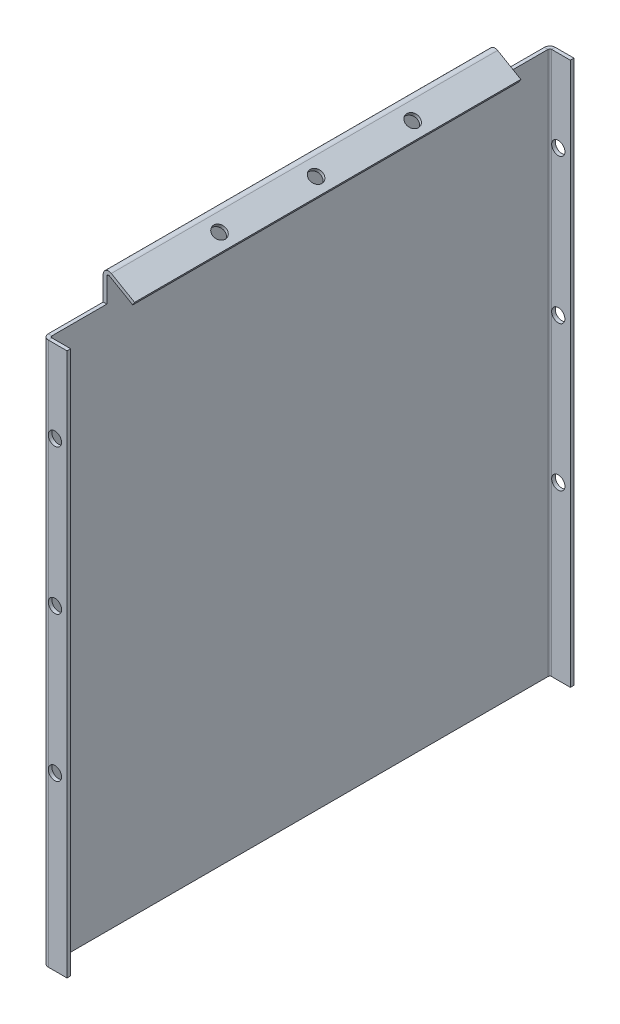
ISO-10303-21;
HEADER;
FILE_DESCRIPTION(('STEP AP214'),'2;1');
FILE_NAME('part.step','',(''),(''),'','','');
FILE_SCHEMA(('AUTOMOTIVE_DESIGN { 1 0 10303 214 1 1 1 1 }'));
ENDSEC;
DATA;
#1=APPLICATION_CONTEXT('core data for automotive mechanical design processes');
#2=APPLICATION_PROTOCOL_DEFINITION('international standard','automotive_design',2000,#1);
#3=PRODUCT_CONTEXT('',#1,'mechanical');
#4=PRODUCT('Part','Part','',(#3));
#5=PRODUCT_RELATED_PRODUCT_CATEGORY('part','',(#4));
#6=PRODUCT_DEFINITION_FORMATION('','',#4);
#7=PRODUCT_DEFINITION_CONTEXT('part definition',#1,'design');
#8=PRODUCT_DEFINITION('design','',#6,#7);
#9=PRODUCT_DEFINITION_SHAPE('','',#8);
#10=(LENGTH_UNIT() NAMED_UNIT(*) SI_UNIT(.MILLI.,.METRE.));
#11=(NAMED_UNIT(*) PLANE_ANGLE_UNIT() SI_UNIT($,.RADIAN.));
#12=(NAMED_UNIT(*) SI_UNIT($,.STERADIAN.) SOLID_ANGLE_UNIT());
#13=UNCERTAINTY_MEASURE_WITH_UNIT(LENGTH_MEASURE(1.E-05),#10,'distance_accuracy_value','');
#14=(GEOMETRIC_REPRESENTATION_CONTEXT(3) GLOBAL_UNCERTAINTY_ASSIGNED_CONTEXT((#13)) GLOBAL_UNIT_ASSIGNED_CONTEXT((#10,
#11,#12)) REPRESENTATION_CONTEXT('',''));
#15=CARTESIAN_POINT('',(0.,0.,0.));
#16=DIRECTION('',(0.,0.,1.));
#17=DIRECTION('',(1.,0.,0.));
#18=AXIS2_PLACEMENT_3D('',#15,#16,#17);
#19=CARTESIAN_POINT('',(1.5,0.,210.));
#20=DIRECTION('',(-1.,0.,0.));
#21=DIRECTION('',(0.,0.,1.));
#22=AXIS2_PLACEMENT_3D('',#19,#20,#21);
#23=PLANE('',#22);
#24=DIRECTION('',(0.,-1.,0.));
#25=VECTOR('',#24,1.);
#26=CARTESIAN_POINT('',(1.50000000000002,0.,207.7634));
#27=LINE('',#26,#25);
#28=CARTESIAN_POINT('',(1.50000000000002,-38.,207.7634));
#29=VERTEX_POINT('',#28);
#30=CARTESIAN_POINT('',(1.50000000000002,186.992120567576,207.7634));
#31=VERTEX_POINT('',#30);
#32=EDGE_CURVE('E325',#29,#31,#27,.F.);
#33=ORIENTED_EDGE('',*,*,#32,.F.);
#34=DIRECTION('',(0.,0.,1.));
#35=VECTOR('',#34,1.);
#36=CARTESIAN_POINT('',(1.50000000000002,-38.,2.2366));
#37=LINE('',#36,#35);
#38=CARTESIAN_POINT('',(1.50000000000002,-38.,2.2366));
#39=VERTEX_POINT('',#38);
#40=EDGE_CURVE('E274',#39,#29,#37,.T.);
#41=ORIENTED_EDGE('',*,*,#40,.F.);
#42=DIRECTION('',(0.,1.,0.));
#43=VECTOR('',#42,1.);
#44=CARTESIAN_POINT('',(1.5,186.992120567576,2.2366));
#45=LINE('',#44,#43);
#46=CARTESIAN_POINT('',(1.5,186.992120567576,2.2366));
#47=VERTEX_POINT('',#46);
#48=EDGE_CURVE('E371',#47,#39,#45,.F.);
#49=ORIENTED_EDGE('',*,*,#48,.F.);
#50=DIRECTION('',(0.,0.,1.));
#51=VECTOR('',#50,1.);
#52=CARTESIAN_POINT('',(1.5,186.992120567576,210.));
#53=LINE('',#52,#51);
#54=CARTESIAN_POINT('',(1.5,186.992120567576,25.));
#55=VERTEX_POINT('',#54);
#56=EDGE_CURVE('E419',#47,#55,#53,.T.);
#57=ORIENTED_EDGE('',*,*,#56,.T.);
#58=DIRECTION('',(0.,1.,0.));
#59=VECTOR('',#58,1.);
#60=CARTESIAN_POINT('',(1.5,0.,25.));
#61=LINE('',#60,#59);
#62=CARTESIAN_POINT('',(1.5,196.992120567576,25.));
#63=VERTEX_POINT('',#62);
#64=EDGE_CURVE('E421',#55,#63,#61,.T.);
#65=ORIENTED_EDGE('',*,*,#64,.T.);
#66=DIRECTION('',(0.,0.,1.));
#67=VECTOR('',#66,1.);
#68=CARTESIAN_POINT('',(1.49999999999999,196.992120567576,210.));
#69=LINE('',#68,#67);
#70=CARTESIAN_POINT('',(1.49999999999999,196.992120567576,185.));
#71=VERTEX_POINT('',#70);
#72=EDGE_CURVE('E447',#71,#63,#69,.F.);
#73=ORIENTED_EDGE('',*,*,#72,.F.);
#74=DIRECTION('',(0.,1.,0.));
#75=VECTOR('',#74,1.);
#76=CARTESIAN_POINT('',(1.49999999999999,186.992120567576,185.));
#77=LINE('',#76,#75);
#78=CARTESIAN_POINT('',(1.49999999999999,186.992120567576,185.));
#79=VERTEX_POINT('',#78);
#80=EDGE_CURVE('E400',#79,#71,#77,.T.);
#81=ORIENTED_EDGE('',*,*,#80,.F.);
#82=DIRECTION('',(0.,0.,1.));
#83=VECTOR('',#82,1.);
#84=CARTESIAN_POINT('',(1.49999999999999,186.992120567576,185.));
#85=LINE('',#84,#83);
#86=EDGE_CURVE('E395',#79,#31,#85,.T.);
#87=ORIENTED_EDGE('',*,*,#86,.T.);
#88=EDGE_LOOP('',(#33,#41,#49,#57,#65,#73,#81,#87));
#89=FACE_BOUND('',#88,.T.);
#90=ADVANCED_FACE('F100',(#89),#23,.F.);
#91=CARTESIAN_POINT('',(0.,0.,210.));
#92=DIRECTION('',(-1.,0.,0.));
#93=DIRECTION('',(0.,0.,1.));
#94=AXIS2_PLACEMENT_3D('',#91,#92,#93);
#95=PLANE('',#94);
#96=DIRECTION('',(0.,1.,0.));
#97=VECTOR('',#96,1.);
#98=CARTESIAN_POINT('',(0.,186.992120567576,2.2366));
#99=LINE('',#98,#97);
#100=CARTESIAN_POINT('',(0.,186.992120567576,2.2366));
#101=VERTEX_POINT('',#100);
#102=CARTESIAN_POINT('',(0.,-38.,2.2366));
#103=VERTEX_POINT('',#102);
#104=EDGE_CURVE('E367',#101,#103,#99,.F.);
#105=ORIENTED_EDGE('',*,*,#104,.T.);
#106=DIRECTION('',(0.,0.,-1.));
#107=VECTOR('',#106,1.);
#108=CARTESIAN_POINT('',(0.,-38.,2.2366));
#109=LINE('',#108,#107);
#110=CARTESIAN_POINT('',(0.,-38.,207.7634));
#111=VERTEX_POINT('',#110);
#112=EDGE_CURVE('E264',#111,#103,#109,.T.);
#113=ORIENTED_EDGE('',*,*,#112,.F.);
#114=DIRECTION('',(0.,-1.,0.));
#115=VECTOR('',#114,1.);
#116=CARTESIAN_POINT('',(0.,0.,207.7634));
#117=LINE('',#116,#115);
#118=CARTESIAN_POINT('',(0.,186.992120567576,207.7634));
#119=VERTEX_POINT('',#118);
#120=EDGE_CURVE('E340',#111,#119,#117,.F.);
#121=ORIENTED_EDGE('',*,*,#120,.T.);
#122=DIRECTION('',(0.,0.,1.));
#123=VECTOR('',#122,1.);
#124=CARTESIAN_POINT('',(0.,186.992120567576,210.));
#125=LINE('',#124,#123);
#126=CARTESIAN_POINT('',(0.,186.992120567576,185.));
#127=VERTEX_POINT('',#126);
#128=EDGE_CURVE('E396',#127,#119,#125,.T.);
#129=ORIENTED_EDGE('',*,*,#128,.F.);
#130=DIRECTION('',(0.,1.,0.));
#131=VECTOR('',#130,1.);
#132=CARTESIAN_POINT('',(0.,0.,185.));
#133=LINE('',#132,#131);
#134=CARTESIAN_POINT('',(0.,196.992120567576,185.));
#135=VERTEX_POINT('',#134);
#136=EDGE_CURVE('E399',#127,#135,#133,.T.);
#137=ORIENTED_EDGE('',*,*,#136,.T.);
#138=DIRECTION('',(0.,0.,1.));
#139=VECTOR('',#138,1.);
#140=CARTESIAN_POINT('',(0.,196.992120567576,210.));
#141=LINE('',#140,#139);
#142=CARTESIAN_POINT('',(0.,196.992120567576,25.));
#143=VERTEX_POINT('',#142);
#144=EDGE_CURVE('E456',#135,#143,#141,.F.);
#145=ORIENTED_EDGE('',*,*,#144,.T.);
#146=DIRECTION('',(0.,1.,0.));
#147=VECTOR('',#146,1.);
#148=CARTESIAN_POINT('',(0.,186.992120567576,25.));
#149=LINE('',#148,#147);
#150=CARTESIAN_POINT('',(0.,186.992120567576,25.));
#151=VERTEX_POINT('',#150);
#152=EDGE_CURVE('E422',#151,#143,#149,.T.);
#153=ORIENTED_EDGE('',*,*,#152,.F.);
#154=DIRECTION('',(0.,0.,1.));
#155=VECTOR('',#154,1.);
#156=CARTESIAN_POINT('',(0.,186.992120567576,25.));
#157=LINE('',#156,#155);
#158=EDGE_CURVE('E418',#101,#151,#157,.T.);
#159=ORIENTED_EDGE('',*,*,#158,.F.);
#160=EDGE_LOOP('',(#105,#113,#121,#129,#137,#145,#153,#159));
#161=FACE_BOUND('',#160,.T.);
#162=ADVANCED_FACE('F490',(#161),#95,.T.);
#163=CARTESIAN_POINT('',(0.,186.992120567576,25.));
#164=DIRECTION('',(0.,-1.,0.));
#165=DIRECTION('',(0.,0.,1.));
#166=AXIS2_PLACEMENT_3D('',#163,#164,#165);
#167=PLANE('',#166);
#168=ORIENTED_EDGE('',*,*,#56,.F.);
#169=DIRECTION('',(-1.,0.,0.));
#170=VECTOR('',#169,1.);
#171=CARTESIAN_POINT('',(1.5,186.992120567576,2.2366));
#172=LINE('',#171,#170);
#173=EDGE_CURVE('E369',#47,#101,#172,.T.);
#174=ORIENTED_EDGE('',*,*,#173,.T.);
#175=ORIENTED_EDGE('',*,*,#158,.T.);
#176=DIRECTION('',(-1.,0.,0.));
#177=VECTOR('',#176,1.);
#178=CARTESIAN_POINT('',(0.,186.992120567576,25.));
#179=LINE('',#178,#177);
#180=EDGE_CURVE('E425',#151,#55,#179,.F.);
#181=ORIENTED_EDGE('',*,*,#180,.T.);
#182=EDGE_LOOP('',(#168,#174,#175,#181));
#183=FACE_BOUND('',#182,.T.);
#184=ADVANCED_FACE('F495',(#183),#167,.F.);
#185=CARTESIAN_POINT('',(2.2366,196.992120567576,210.));
#186=DIRECTION('',(0.,0.,1.));
#187=DIRECTION('',(0.499999999999998,0.86602540378444,0.));
#188=AXIS2_PLACEMENT_3D('',#185,#186,#187);
#189=CYLINDRICAL_SURFACE('',#188,2.23660000000001);
#190=ORIENTED_EDGE('',*,*,#144,.F.);
#191=CARTESIAN_POINT('',(2.2366,196.992120567576,185.));
#192=DIRECTION('',(0.,0.,1.));
#193=DIRECTION('',(1.,0.,0.));
#194=AXIS2_PLACEMENT_3D('',#191,#192,#193);
#195=CIRCLE('',#194,2.23660000000001);
#196=CARTESIAN_POINT('',(3.35489999999998,198.92907298568,185.));
#197=VERTEX_POINT('',#196);
#198=EDGE_CURVE('E415',#135,#197,#195,.F.);
#199=ORIENTED_EDGE('',*,*,#198,.T.);
#200=DIRECTION('',(0.,0.,1.));
#201=VECTOR('',#200,1.);
#202=CARTESIAN_POINT('',(3.35489999999999,198.92907298568,0.));
#203=LINE('',#202,#201);
#204=CARTESIAN_POINT('',(3.35489999999998,198.92907298568,25.));
#205=VERTEX_POINT('',#204);
#206=EDGE_CURVE('E451',#205,#197,#203,.T.);
#207=ORIENTED_EDGE('',*,*,#206,.F.);
#208=CARTESIAN_POINT('',(2.2366,196.992120567576,25.));
#209=DIRECTION('',(0.,0.,-1.));
#210=DIRECTION('',(-1.,0.,0.));
#211=AXIS2_PLACEMENT_3D('',#208,#209,#210);
#212=CIRCLE('',#211,2.23660000000001);
#213=EDGE_CURVE('E440',#205,#143,#212,.F.);
#214=ORIENTED_EDGE('',*,*,#213,.T.);
#215=EDGE_LOOP('',(#190,#199,#207,#214));
#216=FACE_BOUND('',#215,.T.);
#217=ADVANCED_FACE('F551',(#216),#189,.T.);
#218=CARTESIAN_POINT('',(2.2366,196.992120567576,210.));
#219=DIRECTION('',(0.,0.,1.));
#220=DIRECTION('',(0.499999999999998,0.86602540378444,0.));
#221=AXIS2_PLACEMENT_3D('',#218,#219,#220);
#222=CYLINDRICAL_SURFACE('',#221,0.736600000000008);
#223=CARTESIAN_POINT('',(2.2366,196.992120567576,185.));
#224=DIRECTION('',(0.,0.,1.));
#225=DIRECTION('',(1.,0.,0.));
#226=AXIS2_PLACEMENT_3D('',#223,#224,#225);
#227=CIRCLE('',#226,0.736600000000008);
#228=CARTESIAN_POINT('',(2.60489999999998,197.630034880004,185.));
#229=VERTEX_POINT('',#228);
#230=EDGE_CURVE('E413',#71,#229,#227,.F.);
#231=ORIENTED_EDGE('',*,*,#230,.F.);
#232=ORIENTED_EDGE('',*,*,#72,.T.);
#233=CARTESIAN_POINT('',(2.2366,196.992120567576,25.));
#234=DIRECTION('',(0.,0.,-1.));
#235=DIRECTION('',(-1.,0.,0.));
#236=AXIS2_PLACEMENT_3D('',#233,#234,#235);
#237=CIRCLE('',#236,0.736600000000008);
#238=CARTESIAN_POINT('',(2.60489999999998,197.630034880004,25.));
#239=VERTEX_POINT('',#238);
#240=EDGE_CURVE('E437',#239,#63,#237,.F.);
#241=ORIENTED_EDGE('',*,*,#240,.F.);
#242=DIRECTION('',(0.,0.,-1.));
#243=VECTOR('',#242,1.);
#244=CARTESIAN_POINT('',(2.6049,197.630034880004,0.));
#245=LINE('',#244,#243);
#246=EDGE_CURVE('E443',#239,#229,#245,.F.);
#247=ORIENTED_EDGE('',*,*,#246,.T.);
#248=EDGE_LOOP('',(#231,#232,#241,#247));
#249=FACE_BOUND('',#248,.T.);
#250=ADVANCED_FACE('F567',(#249),#222,.F.);
#251=CARTESIAN_POINT('',(87.7275403784436,150.216506350947,0.));
#252=DIRECTION('',(0.499999999999998,0.86602540378444,0.));
#253=DIRECTION('',(-0.86602540378444,0.499999999999998,0.));
#254=AXIS2_PLACEMENT_3D('',#251,#252,#253);
#255=PLANE('',#254);
#256=CARTESIAN_POINT('',(8.17264052838328,196.147549194732,105.));
#257=DIRECTION('',(0.499999999999998,0.86602540378444,0.));
#258=DIRECTION('',(-0.86602540378444,0.499999999999998,0.));
#259=AXIS2_PLACEMENT_3D('',#256,#257,#258);
#260=CIRCLE('',#259,2.75000000000001);
#261=CARTESIAN_POINT('',(5.79107066797607,197.522549194732,105.));
#262=VERTEX_POINT('',#261);
#263=EDGE_CURVE('E386',#262,#262,#260,.T.);
#264=ORIENTED_EDGE('',*,*,#263,.F.);
#265=EDGE_LOOP('',(#264));
#266=FACE_BOUND('',#265,.T.);
#267=CARTESIAN_POINT('',(8.17264052838327,196.147549194732,145.));
#268=DIRECTION('',(0.499999999999998,0.86602540378444,0.));
#269=DIRECTION('',(-0.86602540378444,0.499999999999998,0.));
#270=AXIS2_PLACEMENT_3D('',#267,#268,#269);
#271=CIRCLE('',#270,2.75000000000001);
#272=CARTESIAN_POINT('',(5.79107066797606,197.522549194732,145.));
#273=VERTEX_POINT('',#272);
#274=EDGE_CURVE('E381',#273,#273,#271,.T.);
#275=ORIENTED_EDGE('',*,*,#274,.F.);
#276=EDGE_LOOP('',(#275));
#277=FACE_BOUND('',#276,.T.);
#278=CARTESIAN_POINT('',(8.17264052838328,196.147549194732,65.));
#279=DIRECTION('',(0.499999999999998,0.86602540378444,0.));
#280=DIRECTION('',(-0.86602540378444,0.499999999999998,0.));
#281=AXIS2_PLACEMENT_3D('',#278,#279,#280);
#282=CIRCLE('',#281,2.75000000000001);
#283=CARTESIAN_POINT('',(5.79107066797607,197.522549194732,65.));
#284=VERTEX_POINT('',#283);
#285=EDGE_CURVE('E392',#284,#284,#282,.T.);
#286=ORIENTED_EDGE('',*,*,#285,.F.);
#287=EDGE_LOOP('',(#286));
#288=FACE_BOUND('',#287,.T.);
#289=ORIENTED_EDGE('',*,*,#206,.T.);
#290=DIRECTION('',(0.86602540378444,-0.499999999999998,0.));
#291=VECTOR('',#290,1.);
#292=CARTESIAN_POINT('',(87.7275403784436,150.216506350947,185.));
#293=LINE('',#292,#291);
#294=CARTESIAN_POINT('',(12.9903810567666,193.366025403785,185.));
#295=VERTEX_POINT('',#294);
#296=EDGE_CURVE('E410',#197,#295,#293,.T.);
#297=ORIENTED_EDGE('',*,*,#296,.T.);
#298=DIRECTION('',(0.,0.,1.));
#299=VECTOR('',#298,1.);
#300=CARTESIAN_POINT('',(12.9903810567666,193.366025403784,210.));
#301=LINE('',#300,#299);
#302=CARTESIAN_POINT('',(12.9903810567666,193.366025403784,25.));
#303=VERTEX_POINT('',#302);
#304=EDGE_CURVE('E444',#303,#295,#301,.T.);
#305=ORIENTED_EDGE('',*,*,#304,.F.);
#306=DIRECTION('',(-0.86602540378444,0.499999999999998,0.));
#307=VECTOR('',#306,1.);
#308=CARTESIAN_POINT('',(87.7275403784436,150.216506350947,25.));
#309=LINE('',#308,#307);
#310=EDGE_CURVE('E116',#303,#205,#309,.T.);
#311=ORIENTED_EDGE('',*,*,#310,.T.);
#312=EDGE_LOOP('',(#289,#297,#305,#311));
#313=FACE_BOUND('',#312,.T.);
#314=ADVANCED_FACE('F554',(#266,#277,#288,#313),#255,.T.);
#315=CARTESIAN_POINT('',(86.9775403784436,148.91746824527,0.));
#316=DIRECTION('',(0.499999999999998,0.86602540378444,0.));
#317=DIRECTION('',(-0.86602540378444,0.499999999999998,0.));
#318=AXIS2_PLACEMENT_3D('',#315,#316,#317);
#319=PLANE('',#318);
#320=CARTESIAN_POINT('',(7.4226405283833,194.848511089056,105.));
#321=DIRECTION('',(-0.499999999999998,-0.86602540378444,0.));
#322=DIRECTION('',(0.86602540378444,-0.499999999999998,0.));
#323=AXIS2_PLACEMENT_3D('',#320,#321,#322);
#324=CIRCLE('',#323,2.75000000000001);
#325=CARTESIAN_POINT('',(9.80421038879052,193.473511089056,105.));
#326=VERTEX_POINT('',#325);
#327=EDGE_CURVE('E378',#326,#326,#324,.T.);
#328=ORIENTED_EDGE('',*,*,#327,.F.);
#329=EDGE_LOOP('',(#328));
#330=FACE_BOUND('',#329,.T.);
#331=CARTESIAN_POINT('',(7.42264052838329,194.848511089056,145.));
#332=DIRECTION('',(-0.499999999999998,-0.86602540378444,0.));
#333=DIRECTION('',(-0.86602540378444,0.499999999999998,0.));
#334=AXIS2_PLACEMENT_3D('',#331,#332,#333);
#335=CIRCLE('',#334,2.75000000000001);
#336=CARTESIAN_POINT('',(5.04107066797608,196.223511089056,145.));
#337=VERTEX_POINT('',#336);
#338=EDGE_CURVE('E377',#337,#337,#335,.T.);
#339=ORIENTED_EDGE('',*,*,#338,.F.);
#340=EDGE_LOOP('',(#339));
#341=FACE_BOUND('',#340,.T.);
#342=CARTESIAN_POINT('',(7.4226405283833,194.848511089056,65.));
#343=DIRECTION('',(-0.499999999999998,-0.86602540378444,0.));
#344=DIRECTION('',(0.86602540378444,-0.499999999999998,0.));
#345=AXIS2_PLACEMENT_3D('',#342,#343,#344);
#346=CIRCLE('',#345,2.75000000000001);
#347=CARTESIAN_POINT('',(9.80421038879052,193.473511089056,65.));
#348=VERTEX_POINT('',#347);
#349=EDGE_CURVE('E389',#348,#348,#346,.T.);
#350=ORIENTED_EDGE('',*,*,#349,.F.);
#351=EDGE_LOOP('',(#350));
#352=FACE_BOUND('',#351,.T.);
#353=DIRECTION('',(0.86602540378444,-0.499999999999998,0.));
#354=VECTOR('',#353,1.);
#355=CARTESIAN_POINT('',(86.9775403784436,148.91746824527,185.));
#356=LINE('',#355,#354);
#357=CARTESIAN_POINT('',(12.2403810567666,192.066987298108,185.));
#358=VERTEX_POINT('',#357);
#359=EDGE_CURVE('E408',#229,#358,#356,.T.);
#360=ORIENTED_EDGE('',*,*,#359,.F.);
#361=ORIENTED_EDGE('',*,*,#246,.F.);
#362=DIRECTION('',(-0.86602540378444,0.499999999999998,0.));
#363=VECTOR('',#362,1.);
#364=CARTESIAN_POINT('',(86.9775403784436,148.91746824527,25.));
#365=LINE('',#364,#363);
#366=CARTESIAN_POINT('',(12.2403810567666,192.066987298108,25.));
#367=VERTEX_POINT('',#366);
#368=EDGE_CURVE('E434',#367,#239,#365,.T.);
#369=ORIENTED_EDGE('',*,*,#368,.F.);
#370=DIRECTION('',(0.,0.,-1.));
#371=VECTOR('',#370,1.);
#372=CARTESIAN_POINT('',(12.2403810567666,192.066987298108,0.));
#373=LINE('',#372,#371);
#374=EDGE_CURVE('E448',#367,#358,#373,.F.);
#375=ORIENTED_EDGE('',*,*,#374,.T.);
#376=EDGE_LOOP('',(#360,#361,#369,#375));
#377=FACE_BOUND('',#376,.T.);
#378=ADVANCED_FACE('F564',(#330,#341,#352,#377),#319,.F.);
#379=CARTESIAN_POINT('',(12.9903810567666,193.366025403784,210.));
#380=DIRECTION('',(0.86602540378444,-0.499999999999998,0.));
#381=DIRECTION('',(0.499999999999998,0.86602540378444,0.));
#382=AXIS2_PLACEMENT_3D('',#379,#380,#381);
#383=PLANE('',#382);
#384=ORIENTED_EDGE('',*,*,#304,.T.);
#385=DIRECTION('',(-0.499999999999998,-0.86602540378444,0.));
#386=VECTOR('',#385,1.);
#387=CARTESIAN_POINT('',(12.9903810567666,193.366025403784,185.));
#388=LINE('',#387,#386);
#389=EDGE_CURVE('E13',#295,#358,#388,.T.);
#390=ORIENTED_EDGE('',*,*,#389,.T.);
#391=ORIENTED_EDGE('',*,*,#374,.F.);
#392=DIRECTION('',(0.499999999999998,0.86602540378444,0.));
#393=VECTOR('',#392,1.);
#394=CARTESIAN_POINT('',(12.9903810567666,193.366025403784,25.));
#395=LINE('',#394,#393);
#396=EDGE_CURVE('E458',#367,#303,#395,.T.);
#397=ORIENTED_EDGE('',*,*,#396,.T.);
#398=EDGE_LOOP('',(#384,#390,#391,#397));
#399=FACE_BOUND('',#398,.T.);
#400=ADVANCED_FACE('F557',(#399),#383,.T.);
#401=CARTESIAN_POINT('',(0.,0.,25.));
#402=DIRECTION('',(0.,0.,-1.));
#403=DIRECTION('',(-1.,0.,0.));
#404=AXIS2_PLACEMENT_3D('',#401,#402,#403);
#405=PLANE('',#404);
#406=ORIENTED_EDGE('',*,*,#368,.T.);
#407=DIRECTION('',(0.499999999999998,0.866025403784439,0.));
#408=VECTOR('',#407,1.);
#409=CARTESIAN_POINT('',(2.60489999999998,197.630034880004,25.));
#410=LINE('',#409,#408);
#411=EDGE_CURVE('E108',#239,#205,#410,.T.);
#412=ORIENTED_EDGE('',*,*,#411,.T.);
#413=ORIENTED_EDGE('',*,*,#310,.F.);
#414=ORIENTED_EDGE('',*,*,#396,.F.);
#415=EDGE_LOOP('',(#406,#412,#413,#414));
#416=FACE_BOUND('',#415,.T.);
#417=ADVANCED_FACE('F560',(#416),#405,.T.);
#418=ORIENTED_EDGE('',*,*,#411,.F.);
#419=ORIENTED_EDGE('',*,*,#240,.T.);
#420=DIRECTION('',(-1.,0.,0.));
#421=VECTOR('',#420,1.);
#422=CARTESIAN_POINT('',(0.,196.992120567576,25.));
#423=LINE('',#422,#421);
#424=EDGE_CURVE('E431',#63,#143,#423,.T.);
#425=ORIENTED_EDGE('',*,*,#424,.T.);
#426=ORIENTED_EDGE('',*,*,#213,.F.);
#427=EDGE_LOOP('',(#418,#419,#425,#426));
#428=FACE_BOUND('',#427,.T.);
#429=ADVANCED_FACE('F546',(#428),#405,.T.);
#430=CARTESIAN_POINT('',(0.,186.992120567576,25.));
#431=DIRECTION('',(0.,0.,1.));
#432=DIRECTION('',(0.,1.,0.));
#433=AXIS2_PLACEMENT_3D('',#430,#431,#432);
#434=PLANE('',#433);
#435=ORIENTED_EDGE('',*,*,#152,.T.);
#436=ORIENTED_EDGE('',*,*,#424,.F.);
#437=ORIENTED_EDGE('',*,*,#64,.F.);
#438=ORIENTED_EDGE('',*,*,#180,.F.);
#439=EDGE_LOOP('',(#435,#436,#437,#438));
#440=FACE_BOUND('',#439,.T.);
#441=ADVANCED_FACE('F544',(#440),#434,.F.);
#442=CARTESIAN_POINT('',(0.,0.,185.));
#443=DIRECTION('',(0.,0.,1.));
#444=DIRECTION('',(-1.,0.,0.));
#445=AXIS2_PLACEMENT_3D('',#442,#443,#444);
#446=PLANE('',#445);
#447=ORIENTED_EDGE('',*,*,#198,.F.);
#448=ORIENTED_EDGE('',*,*,#136,.F.);
#449=DIRECTION('',(1.,0.,0.));
#450=VECTOR('',#449,1.);
#451=CARTESIAN_POINT('',(1.49999999999999,186.992120567576,185.));
#452=LINE('',#451,#450);
#453=EDGE_CURVE('E402',#79,#127,#452,.F.);
#454=ORIENTED_EDGE('',*,*,#453,.F.);
#455=ORIENTED_EDGE('',*,*,#80,.T.);
#456=ORIENTED_EDGE('',*,*,#230,.T.);
#457=ORIENTED_EDGE('',*,*,#359,.T.);
#458=ORIENTED_EDGE('',*,*,#389,.F.);
#459=ORIENTED_EDGE('',*,*,#296,.F.);
#460=EDGE_LOOP('',(#447,#448,#454,#455,#456,#457,#458,#459));
#461=FACE_BOUND('',#460,.T.);
#462=ADVANCED_FACE('F569',(#461),#446,.T.);
#463=CARTESIAN_POINT('',(1.49999999999999,186.992120567576,185.));
#464=DIRECTION('',(0.,-1.,0.));
#465=DIRECTION('',(0.,0.,1.));
#466=AXIS2_PLACEMENT_3D('',#463,#464,#465);
#467=PLANE('',#466);
#468=DIRECTION('',(-1.,0.,0.));
#469=VECTOR('',#468,1.);
#470=CARTESIAN_POINT('',(1.50000000000002,186.992120567576,207.7634));
#471=LINE('',#470,#469);
#472=EDGE_CURVE('E347',#31,#119,#471,.T.);
#473=ORIENTED_EDGE('',*,*,#472,.F.);
#474=ORIENTED_EDGE('',*,*,#86,.F.);
#475=ORIENTED_EDGE('',*,*,#453,.T.);
#476=ORIENTED_EDGE('',*,*,#128,.T.);
#477=EDGE_LOOP('',(#473,#474,#475,#476));
#478=FACE_BOUND('',#477,.T.);
#479=ADVANCED_FACE('F529',(#478),#467,.F.);
#480=CARTESIAN_POINT('',(12.4226405283833,203.5087651269,65.));
#481=DIRECTION('',(-0.499999999999998,-0.86602540378444,0.));
#482=DIRECTION('',(0.86602540378444,-0.499999999999998,0.));
#483=AXIS2_PLACEMENT_3D('',#480,#481,#482);
#484=CYLINDRICAL_SURFACE('',#483,2.75000000000001);
#485=ORIENTED_EDGE('',*,*,#285,.T.);
#486=EDGE_LOOP('',(#485));
#487=FACE_BOUND('',#486,.T.);
#488=ORIENTED_EDGE('',*,*,#349,.T.);
#489=EDGE_LOOP('',(#488));
#490=FACE_BOUND('',#489,.T.);
#491=ADVANCED_FACE('F576',(#487,#490),#484,.F.);
#492=CARTESIAN_POINT('',(12.4226405283833,203.5087651269,145.));
#493=DIRECTION('',(-0.499999999999998,-0.86602540378444,0.));
#494=DIRECTION('',(0.86602540378444,-0.499999999999998,0.));
#495=AXIS2_PLACEMENT_3D('',#492,#493,#494);
#496=CYLINDRICAL_SURFACE('',#495,2.75000000000001);
#497=ORIENTED_EDGE('',*,*,#274,.T.);
#498=EDGE_LOOP('',(#497));
#499=FACE_BOUND('',#498,.T.);
#500=ORIENTED_EDGE('',*,*,#338,.T.);
#501=EDGE_LOOP('',(#500));
#502=FACE_BOUND('',#501,.T.);
#503=ADVANCED_FACE('F664',(#499,#502),#496,.F.);
#504=CARTESIAN_POINT('',(12.4226405283833,203.5087651269,105.));
#505=DIRECTION('',(-0.499999999999998,-0.86602540378444,0.));
#506=DIRECTION('',(0.86602540378444,-0.499999999999998,0.));
#507=AXIS2_PLACEMENT_3D('',#504,#505,#506);
#508=CYLINDRICAL_SURFACE('',#507,2.75000000000001);
#509=ORIENTED_EDGE('',*,*,#263,.T.);
#510=EDGE_LOOP('',(#509));
#511=FACE_BOUND('',#510,.T.);
#512=ORIENTED_EDGE('',*,*,#327,.T.);
#513=EDGE_LOOP('',(#512));
#514=FACE_BOUND('',#513,.T.);
#515=ADVANCED_FACE('F674',(#511,#514),#508,.F.);
#516=CARTESIAN_POINT('',(2.2366,186.992120567576,2.2366));
#517=DIRECTION('',(0.,-1.,0.));
#518=DIRECTION('',(0.,0.,-1.));
#519=AXIS2_PLACEMENT_3D('',#516,#517,#518);
#520=PLANE('',#519);
#521=CARTESIAN_POINT('',(2.2366,186.992120567576,2.2366));
#522=DIRECTION('',(0.,1.,0.));
#523=DIRECTION('',(0.,0.,1.));
#524=AXIS2_PLACEMENT_3D('',#521,#522,#523);
#525=CIRCLE('',#524,0.7366);
#526=CARTESIAN_POINT('',(2.23659999999999,186.992120567576,1.5));
#527=VERTEX_POINT('',#526);
#528=EDGE_CURVE('E356',#527,#47,#525,.T.);
#529=ORIENTED_EDGE('',*,*,#528,.F.);
#530=DIRECTION('',(0.,0.,-1.));
#531=VECTOR('',#530,1.);
#532=CARTESIAN_POINT('',(2.2366,186.992120567576,1.5));
#533=LINE('',#532,#531);
#534=CARTESIAN_POINT('',(2.2366,186.992120567576,0.));
#535=VERTEX_POINT('',#534);
#536=EDGE_CURVE('E248',#527,#535,#533,.T.);
#537=ORIENTED_EDGE('',*,*,#536,.T.);
#538=CARTESIAN_POINT('',(2.2366,186.992120567576,2.2366));
#539=DIRECTION('',(0.,1.,0.));
#540=DIRECTION('',(0.,0.,1.));
#541=AXIS2_PLACEMENT_3D('',#538,#539,#540);
#542=CIRCLE('',#541,2.2366);
#543=EDGE_CURVE('E242',#535,#101,#542,.T.);
#544=ORIENTED_EDGE('',*,*,#543,.T.);
#545=ORIENTED_EDGE('',*,*,#173,.F.);
#546=EDGE_LOOP('',(#529,#537,#544,#545));
#547=FACE_BOUND('',#546,.T.);
#548=ADVANCED_FACE('F535',(#547),#520,.F.);
#549=CARTESIAN_POINT('',(2.2366,186.992120567576,2.2366));
#550=DIRECTION('',(0.,1.,0.));
#551=DIRECTION('',(0.,0.,-1.));
#552=AXIS2_PLACEMENT_3D('',#549,#550,#551);
#553=CYLINDRICAL_SURFACE('',#552,2.2366);
#554=ORIENTED_EDGE('',*,*,#104,.F.);
#555=ORIENTED_EDGE('',*,*,#543,.F.);
#556=DIRECTION('',(0.,1.,0.));
#557=VECTOR('',#556,1.);
#558=CARTESIAN_POINT('',(2.2366,0.,0.));
#559=LINE('',#558,#557);
#560=CARTESIAN_POINT('',(2.23659999999999,-38.,0.));
#561=VERTEX_POINT('',#560);
#562=EDGE_CURVE('E236',#561,#535,#559,.T.);
#563=ORIENTED_EDGE('',*,*,#562,.F.);
#564=CARTESIAN_POINT('',(2.2366,-38.,2.2366));
#565=DIRECTION('',(0.,-1.,0.));
#566=DIRECTION('',(0.,0.,-1.));
#567=AXIS2_PLACEMENT_3D('',#564,#565,#566);
#568=CIRCLE('',#567,2.2366);
#569=EDGE_CURVE('E240',#103,#561,#568,.T.);
#570=ORIENTED_EDGE('',*,*,#569,.F.);
#571=EDGE_LOOP('',(#554,#555,#563,#570));
#572=FACE_BOUND('',#571,.T.);
#573=ADVANCED_FACE('F238',(#572),#553,.T.);
#574=CARTESIAN_POINT('',(2.2366,186.992120567576,2.2366));
#575=DIRECTION('',(0.,1.,0.));
#576=DIRECTION('',(0.,0.,-1.));
#577=AXIS2_PLACEMENT_3D('',#574,#575,#576);
#578=CYLINDRICAL_SURFACE('',#577,0.7366);
#579=ORIENTED_EDGE('',*,*,#48,.T.);
#580=CARTESIAN_POINT('',(2.2366,-38.,2.2366));
#581=DIRECTION('',(0.,1.,0.));
#582=DIRECTION('',(0.,0.,-1.));
#583=AXIS2_PLACEMENT_3D('',#580,#581,#582);
#584=CIRCLE('',#583,0.736600000000005);
#585=CARTESIAN_POINT('',(2.2366,-38.,1.49999999999999));
#586=VERTEX_POINT('',#585);
#587=EDGE_CURVE('E271',#586,#39,#584,.T.);
#588=ORIENTED_EDGE('',*,*,#587,.F.);
#589=DIRECTION('',(0.,-1.,0.));
#590=VECTOR('',#589,1.);
#591=CARTESIAN_POINT('',(2.2366,0.,1.5));
#592=LINE('',#591,#590);
#593=EDGE_CURVE('E353',#586,#527,#592,.F.);
#594=ORIENTED_EDGE('',*,*,#593,.T.);
#595=ORIENTED_EDGE('',*,*,#528,.T.);
#596=EDGE_LOOP('',(#579,#588,#594,#595));
#597=FACE_BOUND('',#596,.T.);
#598=ADVANCED_FACE('F710',(#597),#578,.F.);
#599=CARTESIAN_POINT('',(1.49999999999999,186.992120567576,0.));
#600=DIRECTION('',(0.,1.,0.));
#601=DIRECTION('',(-1.,0.,0.));
#602=AXIS2_PLACEMENT_3D('',#599,#600,#601);
#603=PLANE('',#602);
#604=DIRECTION('',(-1.,0.,0.));
#605=VECTOR('',#604,1.);
#606=CARTESIAN_POINT('',(1.49999999999999,186.992120567576,0.));
#607=LINE('',#606,#605);
#608=CARTESIAN_POINT('',(10.,186.992120567576,0.));
#609=VERTEX_POINT('',#608);
#610=EDGE_CURVE('E357',#609,#535,#607,.T.);
#611=ORIENTED_EDGE('',*,*,#610,.T.);
#612=ORIENTED_EDGE('',*,*,#536,.F.);
#613=DIRECTION('',(1.,0.,0.));
#614=VECTOR('',#613,1.);
#615=CARTESIAN_POINT('',(6.105969343459E-13,186.992120567576,1.50000000000001));
#616=LINE('',#615,#614);
#617=CARTESIAN_POINT('',(10.,186.992120567576,1.49999999999997));
#618=VERTEX_POINT('',#617);
#619=EDGE_CURVE('E360',#618,#527,#616,.F.);
#620=ORIENTED_EDGE('',*,*,#619,.F.);
#621=DIRECTION('',(0.,0.,1.));
#622=VECTOR('',#621,1.);
#623=CARTESIAN_POINT('',(10.,186.992120567576,0.));
#624=LINE('',#623,#622);
#625=EDGE_CURVE('E354',#609,#618,#624,.T.);
#626=ORIENTED_EDGE('',*,*,#625,.F.);
#627=EDGE_LOOP('',(#611,#612,#620,#626));
#628=FACE_BOUND('',#627,.T.);
#629=ADVANCED_FACE('F723',(#628),#603,.T.);
#630=CARTESIAN_POINT('',(0.,0.,0.));
#631=DIRECTION('',(0.,0.,-1.));
#632=DIRECTION('',(-1.,0.,0.));
#633=AXIS2_PLACEMENT_3D('',#630,#631,#632);
#634=PLANE('',#633);
#635=CARTESIAN_POINT('',(5.00000000000007,93.0000000000021,0.));
#636=DIRECTION('',(0.,0.,-1.));
#637=DIRECTION('',(-1.,0.,0.));
#638=AXIS2_PLACEMENT_3D('',#635,#636,#637);
#639=CIRCLE('',#638,2.74999999999965);
#640=CARTESIAN_POINT('',(2.25000000000043,93.0000000000021,0.));
#641=VERTEX_POINT('',#640);
#642=EDGE_CURVE('E297',#641,#641,#639,.T.);
#643=ORIENTED_EDGE('',*,*,#642,.F.);
#644=EDGE_LOOP('',(#643));
#645=FACE_BOUND('',#644,.T.);
#646=CARTESIAN_POINT('',(5.00000000000007,33.0000000000021,0.));
#647=DIRECTION('',(0.,0.,-1.));
#648=DIRECTION('',(-1.,0.,0.));
#649=AXIS2_PLACEMENT_3D('',#646,#647,#648);
#650=CIRCLE('',#649,2.74999999999965);
#651=CARTESIAN_POINT('',(2.25000000000042,33.0000000000021,0.));
#652=VERTEX_POINT('',#651);
#653=EDGE_CURVE('E292',#652,#652,#650,.T.);
#654=ORIENTED_EDGE('',*,*,#653,.F.);
#655=EDGE_LOOP('',(#654));
#656=FACE_BOUND('',#655,.T.);
#657=CARTESIAN_POINT('',(5.00000000000008,153.000000000002,0.));
#658=DIRECTION('',(0.,0.,-1.));
#659=DIRECTION('',(-1.,0.,0.));
#660=AXIS2_PLACEMENT_3D('',#657,#658,#659);
#661=CIRCLE('',#660,2.75);
#662=CARTESIAN_POINT('',(2.25000000000008,153.000000000002,0.));
#663=VERTEX_POINT('',#662);
#664=EDGE_CURVE('E311',#663,#663,#661,.T.);
#665=ORIENTED_EDGE('',*,*,#664,.F.);
#666=EDGE_LOOP('',(#665));
#667=FACE_BOUND('',#666,.T.);
#668=DIRECTION('',(0.,1.,0.));
#669=VECTOR('',#668,1.);
#670=CARTESIAN_POINT('',(10.,186.992120567576,0.));
#671=LINE('',#670,#669);
#672=CARTESIAN_POINT('',(10.,-38.,0.));
#673=VERTEX_POINT('',#672);
#674=EDGE_CURVE('E254',#673,#609,#671,.T.);
#675=ORIENTED_EDGE('',*,*,#674,.F.);
#676=DIRECTION('',(1.,0.,0.));
#677=VECTOR('',#676,1.);
#678=CARTESIAN_POINT('',(2.23659999999999,-38.,0.));
#679=LINE('',#678,#677);
#680=EDGE_CURVE('E251',#561,#673,#679,.T.);
#681=ORIENTED_EDGE('',*,*,#680,.F.);
#682=ORIENTED_EDGE('',*,*,#562,.T.);
#683=ORIENTED_EDGE('',*,*,#610,.F.);
#684=EDGE_LOOP('',(#675,#681,#682,#683));
#685=FACE_BOUND('',#684,.T.);
#686=ADVANCED_FACE('F252',(#645,#656,#667,#685),#634,.T.);
#687=CARTESIAN_POINT('',(0.,0.,1.50000000000001));
#688=DIRECTION('',(0.,0.,-1.));
#689=DIRECTION('',(-1.,0.,0.));
#690=AXIS2_PLACEMENT_3D('',#687,#688,#689);
#691=PLANE('',#690);
#692=CARTESIAN_POINT('',(5.00000000000008,93.0000000000021,1.49999999999997));
#693=DIRECTION('',(0.,0.,-1.));
#694=DIRECTION('',(-1.,0.,0.));
#695=AXIS2_PLACEMENT_3D('',#692,#693,#694);
#696=CIRCLE('',#695,2.74999999999965);
#697=CARTESIAN_POINT('',(2.25000000000043,93.0000000000021,1.49999999999998));
#698=VERTEX_POINT('',#697);
#699=EDGE_CURVE('E308',#698,#698,#696,.T.);
#700=ORIENTED_EDGE('',*,*,#699,.T.);
#701=EDGE_LOOP('',(#700));
#702=FACE_BOUND('',#701,.T.);
#703=CARTESIAN_POINT('',(5.00000000000008,33.0000000000021,1.49999999999997));
#704=DIRECTION('',(0.,0.,-1.));
#705=DIRECTION('',(-1.,0.,0.));
#706=AXIS2_PLACEMENT_3D('',#703,#704,#705);
#707=CIRCLE('',#706,2.74999999999965);
#708=CARTESIAN_POINT('',(2.25000000000043,33.0000000000021,1.49999999999998));
#709=VERTEX_POINT('',#708);
#710=EDGE_CURVE('E305',#709,#709,#707,.T.);
#711=ORIENTED_EDGE('',*,*,#710,.T.);
#712=EDGE_LOOP('',(#711));
#713=FACE_BOUND('',#712,.T.);
#714=CARTESIAN_POINT('',(5.00000000000008,153.000000000002,1.49999999999997));
#715=DIRECTION('',(0.,0.,-1.));
#716=DIRECTION('',(-1.,0.,0.));
#717=AXIS2_PLACEMENT_3D('',#714,#715,#716);
#718=CIRCLE('',#717,2.75);
#719=CARTESIAN_POINT('',(2.25000000000008,153.000000000002,1.49999999999998));
#720=VERTEX_POINT('',#719);
#721=EDGE_CURVE('E318',#720,#720,#718,.T.);
#722=ORIENTED_EDGE('',*,*,#721,.T.);
#723=EDGE_LOOP('',(#722));
#724=FACE_BOUND('',#723,.T.);
#725=ORIENTED_EDGE('',*,*,#593,.F.);
#726=DIRECTION('',(-1.,0.,0.));
#727=VECTOR('',#726,1.);
#728=CARTESIAN_POINT('',(2.23659999999999,-38.,1.49999999999997));
#729=LINE('',#728,#727);
#730=CARTESIAN_POINT('',(10.,-38.,1.49999999999997));
#731=VERTEX_POINT('',#730);
#732=EDGE_CURVE('E268',#731,#586,#729,.T.);
#733=ORIENTED_EDGE('',*,*,#732,.F.);
#734=DIRECTION('',(0.,-1.,0.));
#735=VECTOR('',#734,1.);
#736=CARTESIAN_POINT('',(10.,0.,1.49999999999997));
#737=LINE('',#736,#735);
#738=EDGE_CURVE('E247',#731,#618,#737,.F.);
#739=ORIENTED_EDGE('',*,*,#738,.T.);
#740=ORIENTED_EDGE('',*,*,#619,.T.);
#741=EDGE_LOOP('',(#725,#733,#739,#740));
#742=FACE_BOUND('',#741,.T.);
#743=ADVANCED_FACE('F745',(#702,#713,#724,#742),#691,.F.);
#744=CARTESIAN_POINT('',(10.,186.992120567576,0.));
#745=DIRECTION('',(1.,0.,0.));
#746=DIRECTION('',(0.,0.,-1.));
#747=AXIS2_PLACEMENT_3D('',#744,#745,#746);
#748=PLANE('',#747);
#749=ORIENTED_EDGE('',*,*,#738,.F.);
#750=DIRECTION('',(0.,0.,1.));
#751=VECTOR('',#750,1.);
#752=CARTESIAN_POINT('',(10.,-38.,0.));
#753=LINE('',#752,#751);
#754=EDGE_CURVE('E258',#673,#731,#753,.T.);
#755=ORIENTED_EDGE('',*,*,#754,.F.);
#756=ORIENTED_EDGE('',*,*,#674,.T.);
#757=ORIENTED_EDGE('',*,*,#625,.T.);
#758=EDGE_LOOP('',(#749,#755,#756,#757));
#759=FACE_BOUND('',#758,.T.);
#760=ADVANCED_FACE('F758',(#759),#748,.T.);
#761=CARTESIAN_POINT('',(2.23660000000002,186.992120567576,207.7634));
#762=DIRECTION('',(0.,1.,0.));
#763=DIRECTION('',(0.,0.,1.));
#764=AXIS2_PLACEMENT_3D('',#761,#762,#763);
#765=PLANE('',#764);
#766=DIRECTION('',(0.,0.,1.));
#767=VECTOR('',#766,1.);
#768=CARTESIAN_POINT('',(2.23660000000001,186.992120567576,210.));
#769=LINE('',#768,#767);
#770=CARTESIAN_POINT('',(2.23660000000002,186.992120567576,208.5));
#771=VERTEX_POINT('',#770);
#772=CARTESIAN_POINT('',(2.23660000000001,186.992120567576,210.));
#773=VERTEX_POINT('',#772);
#774=EDGE_CURVE('E321',#771,#773,#769,.T.);
#775=ORIENTED_EDGE('',*,*,#774,.F.);
#776=CARTESIAN_POINT('',(2.23660000000002,186.992120567576,207.7634));
#777=DIRECTION('',(0.,-1.,0.));
#778=DIRECTION('',(0.,0.,-1.));
#779=AXIS2_PLACEMENT_3D('',#776,#777,#778);
#780=CIRCLE('',#779,0.736600000000004);
#781=EDGE_CURVE('E344',#31,#771,#780,.F.);
#782=ORIENTED_EDGE('',*,*,#781,.F.);
#783=ORIENTED_EDGE('',*,*,#472,.T.);
#784=CARTESIAN_POINT('',(2.23660000000002,186.992120567576,207.7634));
#785=DIRECTION('',(0.,-1.,0.));
#786=DIRECTION('',(0.,0.,-1.));
#787=AXIS2_PLACEMENT_3D('',#784,#785,#786);
#788=CIRCLE('',#787,2.2366);
#789=EDGE_CURVE('E343',#119,#773,#788,.F.);
#790=ORIENTED_EDGE('',*,*,#789,.T.);
#791=EDGE_LOOP('',(#775,#782,#783,#790));
#792=FACE_BOUND('',#791,.T.);
#793=ADVANCED_FACE('F525',(#792),#765,.T.);
#794=CARTESIAN_POINT('',(2.23660000000002,0.,207.7634));
#795=DIRECTION('',(0.,-1.,0.));
#796=DIRECTION('',(0.,0.,1.));
#797=AXIS2_PLACEMENT_3D('',#794,#795,#796);
#798=CYLINDRICAL_SURFACE('',#797,2.2366);
#799=ORIENTED_EDGE('',*,*,#120,.F.);
#800=CARTESIAN_POINT('',(2.23660000000002,-38.,207.7634));
#801=DIRECTION('',(0.,-1.,0.));
#802=DIRECTION('',(0.,0.,-1.));
#803=AXIS2_PLACEMENT_3D('',#800,#801,#802);
#804=CIRCLE('',#803,2.23660000000003);
#805=CARTESIAN_POINT('',(2.23660000000002,-38.,210.));
#806=VERTEX_POINT('',#805);
#807=EDGE_CURVE('E289',#806,#111,#804,.T.);
#808=ORIENTED_EDGE('',*,*,#807,.F.);
#809=DIRECTION('',(0.,-1.,0.));
#810=VECTOR('',#809,1.);
#811=CARTESIAN_POINT('',(2.23660000000003,0.,210.));
#812=LINE('',#811,#810);
#813=EDGE_CURVE('E334',#773,#806,#812,.T.);
#814=ORIENTED_EDGE('',*,*,#813,.F.);
#815=ORIENTED_EDGE('',*,*,#789,.F.);
#816=EDGE_LOOP('',(#799,#808,#814,#815));
#817=FACE_BOUND('',#816,.T.);
#818=ADVANCED_FACE('F523',(#817),#798,.T.);
#819=CARTESIAN_POINT('',(2.23660000000002,0.,207.7634));
#820=DIRECTION('',(0.,-1.,0.));
#821=DIRECTION('',(0.,0.,1.));
#822=AXIS2_PLACEMENT_3D('',#819,#820,#821);
#823=CYLINDRICAL_SURFACE('',#822,0.736600000000004);
#824=ORIENTED_EDGE('',*,*,#32,.T.);
#825=ORIENTED_EDGE('',*,*,#781,.T.);
#826=DIRECTION('',(0.,1.,0.));
#827=VECTOR('',#826,1.);
#828=CARTESIAN_POINT('',(2.23660000000001,186.992120567576,208.5));
#829=LINE('',#828,#827);
#830=CARTESIAN_POINT('',(2.23660000000002,-38.,208.5));
#831=VERTEX_POINT('',#830);
#832=EDGE_CURVE('E336',#771,#831,#829,.F.);
#833=ORIENTED_EDGE('',*,*,#832,.T.);
#834=CARTESIAN_POINT('',(2.23660000000002,-38.,207.7634));
#835=DIRECTION('',(0.,1.,0.));
#836=DIRECTION('',(0.,0.,-1.));
#837=AXIS2_PLACEMENT_3D('',#834,#835,#836);
#838=CIRCLE('',#837,0.736600000000004);
#839=EDGE_CURVE('E277',#29,#831,#838,.T.);
#840=ORIENTED_EDGE('',*,*,#839,.F.);
#841=EDGE_LOOP('',(#824,#825,#833,#840));
#842=FACE_BOUND('',#841,.T.);
#843=ADVANCED_FACE('F505',(#842),#823,.F.);
#844=CARTESIAN_POINT('',(9.99999999999999,186.992120567576,210.));
#845=DIRECTION('',(0.,1.,0.));
#846=DIRECTION('',(0.,0.,1.));
#847=AXIS2_PLACEMENT_3D('',#844,#845,#846);
#848=PLANE('',#847);
#849=DIRECTION('',(-1.,0.,0.));
#850=VECTOR('',#849,1.);
#851=CARTESIAN_POINT('',(-6.8572598579789E-13,186.992120567576,208.5));
#852=LINE('',#851,#850);
#853=CARTESIAN_POINT('',(9.99999999999999,186.992120567576,208.5));
#854=VERTEX_POINT('',#853);
#855=EDGE_CURVE('E332',#771,#854,#852,.F.);
#856=ORIENTED_EDGE('',*,*,#855,.F.);
#857=ORIENTED_EDGE('',*,*,#774,.T.);
#858=DIRECTION('',(1.,0.,0.));
#859=VECTOR('',#858,1.);
#860=CARTESIAN_POINT('',(9.99999999999999,186.992120567576,210.));
#861=LINE('',#860,#859);
#862=CARTESIAN_POINT('',(9.99999999999999,186.992120567576,210.));
#863=VERTEX_POINT('',#862);
#864=EDGE_CURVE('E328',#773,#863,#861,.T.);
#865=ORIENTED_EDGE('',*,*,#864,.T.);
#866=DIRECTION('',(0.,0.,-1.));
#867=VECTOR('',#866,1.);
#868=CARTESIAN_POINT('',(9.99999999999999,186.992120567576,210.));
#869=LINE('',#868,#867);
#870=EDGE_CURVE('E322',#863,#854,#869,.T.);
#871=ORIENTED_EDGE('',*,*,#870,.T.);
#872=EDGE_LOOP('',(#856,#857,#865,#871));
#873=FACE_BOUND('',#872,.T.);
#874=ADVANCED_FACE('F510',(#873),#848,.T.);
#875=CARTESIAN_POINT('',(-6.90963207806155E-13,0.,210.));
#876=DIRECTION('',(0.,0.,1.));
#877=DIRECTION('',(1.,0.,0.));
#878=AXIS2_PLACEMENT_3D('',#875,#876,#877);
#879=PLANE('',#878);
#880=CARTESIAN_POINT('',(5.00000000000081,93.0000000000021,210.));
#881=DIRECTION('',(0.,0.,-1.));
#882=DIRECTION('',(-1.,0.,0.));
#883=AXIS2_PLACEMENT_3D('',#880,#881,#882);
#884=CIRCLE('',#883,2.74999999999965);
#885=CARTESIAN_POINT('',(2.25000000000116,93.0000000000021,210.));
#886=VERTEX_POINT('',#885);
#887=EDGE_CURVE('E293',#886,#886,#884,.T.);
#888=ORIENTED_EDGE('',*,*,#887,.T.);
#889=EDGE_LOOP('',(#888));
#890=FACE_BOUND('',#889,.T.);
#891=CARTESIAN_POINT('',(5.0000000000008,33.0000000000021,210.));
#892=DIRECTION('',(0.,0.,-1.));
#893=DIRECTION('',(-1.,0.,0.));
#894=AXIS2_PLACEMENT_3D('',#891,#892,#893);
#895=CIRCLE('',#894,2.74999999999965);
#896=CARTESIAN_POINT('',(2.25000000000116,33.0000000000021,210.));
#897=VERTEX_POINT('',#896);
#898=EDGE_CURVE('E300',#897,#897,#895,.T.);
#899=ORIENTED_EDGE('',*,*,#898,.T.);
#900=EDGE_LOOP('',(#899));
#901=FACE_BOUND('',#900,.T.);
#902=CARTESIAN_POINT('',(5.00000000000081,153.000000000002,210.));
#903=DIRECTION('',(0.,0.,-1.));
#904=DIRECTION('',(-1.,0.,0.));
#905=AXIS2_PLACEMENT_3D('',#902,#903,#904);
#906=CIRCLE('',#905,2.75);
#907=CARTESIAN_POINT('',(2.25000000000081,153.000000000002,210.));
#908=VERTEX_POINT('',#907);
#909=EDGE_CURVE('E312',#908,#908,#906,.T.);
#910=ORIENTED_EDGE('',*,*,#909,.T.);
#911=EDGE_LOOP('',(#910));
#912=FACE_BOUND('',#911,.T.);
#913=ORIENTED_EDGE('',*,*,#864,.F.);
#914=ORIENTED_EDGE('',*,*,#813,.T.);
#915=DIRECTION('',(-1.,0.,0.));
#916=VECTOR('',#915,1.);
#917=CARTESIAN_POINT('',(2.23660000000002,-38.,210.));
#918=LINE('',#917,#916);
#919=CARTESIAN_POINT('',(10.,-38.,210.));
#920=VERTEX_POINT('',#919);
#921=EDGE_CURVE('E286',#920,#806,#918,.T.);
#922=ORIENTED_EDGE('',*,*,#921,.F.);
#923=DIRECTION('',(0.,-1.,0.));
#924=VECTOR('',#923,1.);
#925=CARTESIAN_POINT('',(10.,0.,210.));
#926=LINE('',#925,#924);
#927=EDGE_CURVE('E326',#863,#920,#926,.T.);
#928=ORIENTED_EDGE('',*,*,#927,.F.);
#929=EDGE_LOOP('',(#913,#914,#922,#928));
#930=FACE_BOUND('',#929,.T.);
#931=ADVANCED_FACE('F521',(#890,#901,#912,#930),#879,.T.);
#932=CARTESIAN_POINT('',(-6.8572598579789E-13,0.,208.5));
#933=DIRECTION('',(0.,0.,1.));
#934=DIRECTION('',(1.,0.,0.));
#935=AXIS2_PLACEMENT_3D('',#932,#933,#934);
#936=PLANE('',#935);
#937=CARTESIAN_POINT('',(5.0000000000008,93.0000000000021,208.5));
#938=DIRECTION('',(0.,0.,1.));
#939=DIRECTION('',(1.,0.,0.));
#940=AXIS2_PLACEMENT_3D('',#937,#938,#939);
#941=CIRCLE('',#940,2.74999999999965);
#942=CARTESIAN_POINT('',(7.75000000000045,93.0000000000021,208.5));
#943=VERTEX_POINT('',#942);
#944=EDGE_CURVE('E103',#943,#943,#941,.T.);
#945=ORIENTED_EDGE('',*,*,#944,.T.);
#946=EDGE_LOOP('',(#945));
#947=FACE_BOUND('',#946,.T.);
#948=CARTESIAN_POINT('',(5.0000000000008,33.0000000000021,208.5));
#949=DIRECTION('',(0.,0.,1.));
#950=DIRECTION('',(1.,0.,0.));
#951=AXIS2_PLACEMENT_3D('',#948,#949,#950);
#952=CIRCLE('',#951,2.74999999999965);
#953=CARTESIAN_POINT('',(7.75000000000045,33.0000000000021,208.5));
#954=VERTEX_POINT('',#953);
#955=EDGE_CURVE('E296',#954,#954,#952,.T.);
#956=ORIENTED_EDGE('',*,*,#955,.T.);
#957=EDGE_LOOP('',(#956));
#958=FACE_BOUND('',#957,.T.);
#959=CARTESIAN_POINT('',(5.00000000000081,153.000000000002,208.5));
#960=DIRECTION('',(0.,0.,1.));
#961=DIRECTION('',(1.,0.,0.));
#962=AXIS2_PLACEMENT_3D('',#959,#960,#961);
#963=CIRCLE('',#962,2.75);
#964=CARTESIAN_POINT('',(7.75000000000081,153.000000000002,208.5));
#965=VERTEX_POINT('',#964);
#966=EDGE_CURVE('E315',#965,#965,#963,.T.);
#967=ORIENTED_EDGE('',*,*,#966,.T.);
#968=EDGE_LOOP('',(#967));
#969=FACE_BOUND('',#968,.T.);
#970=ORIENTED_EDGE('',*,*,#832,.F.);
#971=ORIENTED_EDGE('',*,*,#855,.T.);
#972=DIRECTION('',(0.,1.,0.));
#973=VECTOR('',#972,1.);
#974=CARTESIAN_POINT('',(10.,0.,208.5));
#975=LINE('',#974,#973);
#976=CARTESIAN_POINT('',(10.,-38.,208.5));
#977=VERTEX_POINT('',#976);
#978=EDGE_CURVE('E330',#854,#977,#975,.F.);
#979=ORIENTED_EDGE('',*,*,#978,.T.);
#980=DIRECTION('',(1.,0.,0.));
#981=VECTOR('',#980,1.);
#982=CARTESIAN_POINT('',(2.23660000000002,-38.,208.5));
#983=LINE('',#982,#981);
#984=EDGE_CURVE('E280',#831,#977,#983,.T.);
#985=ORIENTED_EDGE('',*,*,#984,.F.);
#986=EDGE_LOOP('',(#970,#971,#979,#985));
#987=FACE_BOUND('',#986,.T.);
#988=ADVANCED_FACE('F466',(#947,#958,#969,#987),#936,.F.);
#989=CARTESIAN_POINT('',(10.,0.,210.));
#990=DIRECTION('',(1.,0.,0.));
#991=DIRECTION('',(0.,0.,-1.));
#992=AXIS2_PLACEMENT_3D('',#989,#990,#991);
#993=PLANE('',#992);
#994=ORIENTED_EDGE('',*,*,#978,.F.);
#995=ORIENTED_EDGE('',*,*,#870,.F.);
#996=ORIENTED_EDGE('',*,*,#927,.T.);
#997=DIRECTION('',(0.,0.,1.));
#998=VECTOR('',#997,1.);
#999=CARTESIAN_POINT('',(10.,-38.,208.5));
#1000=LINE('',#999,#998);
#1001=EDGE_CURVE('E283',#977,#920,#1000,.T.);
#1002=ORIENTED_EDGE('',*,*,#1001,.F.);
#1003=EDGE_LOOP('',(#994,#995,#996,#1002));
#1004=FACE_BOUND('',#1003,.T.);
#1005=ADVANCED_FACE('F517',(#1004),#993,.T.);
#1006=CARTESIAN_POINT('',(5.00000000000081,153.000000000002,210.));
#1007=DIRECTION('',(0.,0.,-1.));
#1008=DIRECTION('',(-1.,0.,0.));
#1009=AXIS2_PLACEMENT_3D('',#1006,#1007,#1008);
#1010=CYLINDRICAL_SURFACE('',#1009,2.75);
#1011=ORIENTED_EDGE('',*,*,#909,.F.);
#1012=EDGE_LOOP('',(#1011));
#1013=FACE_BOUND('',#1012,.T.);
#1014=ORIENTED_EDGE('',*,*,#966,.F.);
#1015=EDGE_LOOP('',(#1014));
#1016=FACE_BOUND('',#1015,.T.);
#1017=ADVANCED_FACE('F483',(#1013,#1016),#1010,.F.);
#1018=ORIENTED_EDGE('',*,*,#664,.T.);
#1019=EDGE_LOOP('',(#1018));
#1020=FACE_BOUND('',#1019,.T.);
#1021=ORIENTED_EDGE('',*,*,#721,.F.);
#1022=EDGE_LOOP('',(#1021));
#1023=FACE_BOUND('',#1022,.T.);
#1024=ADVANCED_FACE('F472',(#1020,#1023),#1010,.F.);
#1025=CARTESIAN_POINT('',(5.0000000000008,33.0000000000021,210.));
#1026=DIRECTION('',(0.,0.,-1.));
#1027=DIRECTION('',(-1.,0.,0.));
#1028=AXIS2_PLACEMENT_3D('',#1025,#1026,#1027);
#1029=CYLINDRICAL_SURFACE('',#1028,2.74999999999965);
#1030=ORIENTED_EDGE('',*,*,#898,.F.);
#1031=EDGE_LOOP('',(#1030));
#1032=FACE_BOUND('',#1031,.T.);
#1033=ORIENTED_EDGE('',*,*,#955,.F.);
#1034=EDGE_LOOP('',(#1033));
#1035=FACE_BOUND('',#1034,.T.);
#1036=ADVANCED_FACE('F469',(#1032,#1035),#1029,.F.);
#1037=CARTESIAN_POINT('',(5.00000000000081,93.0000000000021,210.));
#1038=DIRECTION('',(0.,0.,-1.));
#1039=DIRECTION('',(-1.,0.,0.));
#1040=AXIS2_PLACEMENT_3D('',#1037,#1038,#1039);
#1041=CYLINDRICAL_SURFACE('',#1040,2.74999999999965);
#1042=ORIENTED_EDGE('',*,*,#887,.F.);
#1043=EDGE_LOOP('',(#1042));
#1044=FACE_BOUND('',#1043,.T.);
#1045=ORIENTED_EDGE('',*,*,#944,.F.);
#1046=EDGE_LOOP('',(#1045));
#1047=FACE_BOUND('',#1046,.T.);
#1048=ADVANCED_FACE('F471',(#1044,#1047),#1041,.F.);
#1049=ORIENTED_EDGE('',*,*,#653,.T.);
#1050=EDGE_LOOP('',(#1049));
#1051=FACE_BOUND('',#1050,.T.);
#1052=ORIENTED_EDGE('',*,*,#710,.F.);
#1053=EDGE_LOOP('',(#1052));
#1054=FACE_BOUND('',#1053,.T.);
#1055=ADVANCED_FACE('F475',(#1051,#1054),#1029,.F.);
#1056=ORIENTED_EDGE('',*,*,#642,.T.);
#1057=EDGE_LOOP('',(#1056));
#1058=FACE_BOUND('',#1057,.T.);
#1059=ORIENTED_EDGE('',*,*,#699,.F.);
#1060=EDGE_LOOP('',(#1059));
#1061=FACE_BOUND('',#1060,.T.);
#1062=ADVANCED_FACE('F482',(#1058,#1061),#1041,.F.);
#1063=CARTESIAN_POINT('',(2.2366,-38.,2.2366));
#1064=DIRECTION('',(0.,-1.,0.));
#1065=DIRECTION('',(0.,0.,-1.));
#1066=AXIS2_PLACEMENT_3D('',#1063,#1064,#1065);
#1067=PLANE('',#1066);
#1068=ORIENTED_EDGE('',*,*,#569,.T.);
#1069=ORIENTED_EDGE('',*,*,#680,.T.);
#1070=ORIENTED_EDGE('',*,*,#754,.T.);
#1071=ORIENTED_EDGE('',*,*,#732,.T.);
#1072=ORIENTED_EDGE('',*,*,#587,.T.);
#1073=ORIENTED_EDGE('',*,*,#40,.T.);
#1074=ORIENTED_EDGE('',*,*,#839,.T.);
#1075=ORIENTED_EDGE('',*,*,#984,.T.);
#1076=ORIENTED_EDGE('',*,*,#1001,.T.);
#1077=ORIENTED_EDGE('',*,*,#921,.T.);
#1078=ORIENTED_EDGE('',*,*,#807,.T.);
#1079=ORIENTED_EDGE('',*,*,#112,.T.);
#1080=EDGE_LOOP('',(#1068,#1069,#1070,#1071,#1072,#1073,#1074,#1075,#1076,#1077,#1078,#1079));
#1081=FACE_BOUND('',#1080,.T.);
#1082=ADVANCED_FACE('F261',(#1081),#1067,.T.);
#1083=CLOSED_SHELL('',(#90,#162,#184,#217,#250,#314,#378,#400,#417,#429,#441,#462,#479,#491,
#503,#515,#548,#573,#598,#629,#686,#743,#760,#793,#818,#843,#874,#931,#988,#1005,#1017,#1024,
#1036,#1048,#1055,#1062,#1082));
#1084=MANIFOLD_SOLID_BREP('B2',#1083);
#1085=ADVANCED_BREP_SHAPE_REPRESENTATION('',(#18,#1084),#14);
#1086=SHAPE_DEFINITION_REPRESENTATION(#9,#1085);
ENDSEC;
END-ISO-10303-21;
